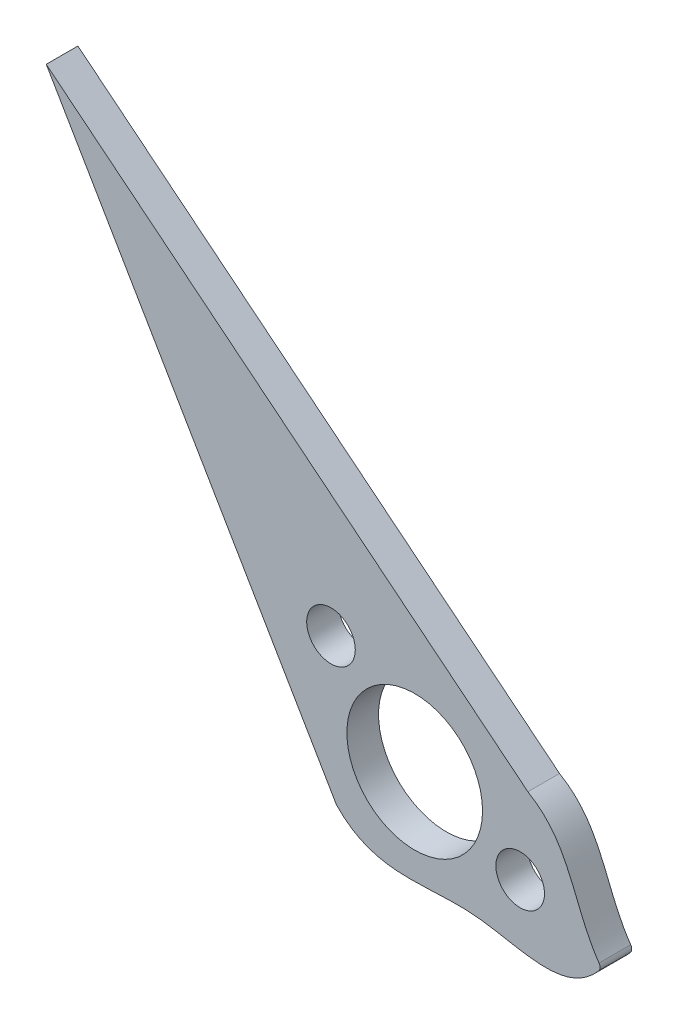
ISO-10303-21;
HEADER;
FILE_DESCRIPTION(('STEP AP214'),'2;1');
FILE_NAME('part.step','',(''),(''),'','','');
FILE_SCHEMA(('AUTOMOTIVE_DESIGN { 1 0 10303 214 1 1 1 1 }'));
ENDSEC;
DATA;
#1=APPLICATION_CONTEXT('core data for automotive mechanical design processes');
#2=APPLICATION_PROTOCOL_DEFINITION('international standard','automotive_design',2000,#1);
#3=PRODUCT_CONTEXT('',#1,'mechanical');
#4=PRODUCT('Part','Part','',(#3));
#5=PRODUCT_RELATED_PRODUCT_CATEGORY('part','',(#4));
#6=PRODUCT_DEFINITION_FORMATION('','',#4);
#7=PRODUCT_DEFINITION_CONTEXT('part definition',#1,'design');
#8=PRODUCT_DEFINITION('design','',#6,#7);
#9=PRODUCT_DEFINITION_SHAPE('','',#8);
#10=(LENGTH_UNIT() NAMED_UNIT(*) SI_UNIT(.MILLI.,.METRE.));
#11=(NAMED_UNIT(*) PLANE_ANGLE_UNIT() SI_UNIT($,.RADIAN.));
#12=(NAMED_UNIT(*) SI_UNIT($,.STERADIAN.) SOLID_ANGLE_UNIT());
#13=UNCERTAINTY_MEASURE_WITH_UNIT(LENGTH_MEASURE(1.E-05),#10,'distance_accuracy_value','');
#14=(GEOMETRIC_REPRESENTATION_CONTEXT(3) GLOBAL_UNCERTAINTY_ASSIGNED_CONTEXT((#13)) GLOBAL_UNIT_ASSIGNED_CONTEXT((#10,
#11,#12)) REPRESENTATION_CONTEXT('',''));
#15=CARTESIAN_POINT('',(0.,0.,0.));
#16=DIRECTION('',(0.,0.,1.));
#17=DIRECTION('',(1.,0.,0.));
#18=AXIS2_PLACEMENT_3D('',#15,#16,#17);
#19=CARTESIAN_POINT('',(-7.76901962768053,-4.54338354365057,2.8));
#20=DIRECTION('',(-0.863224403075614,-0.504820393738952,0.));
#21=DIRECTION('',(0.504820393738952,-0.863224403075614,0.));
#22=AXIS2_PLACEMENT_3D('',#19,#20,#21);
#23=PLANE('',#22);
#24=DIRECTION('',(-0.504820393738952,0.863224403075614,0.));
#25=VECTOR('',#24,1.);
#26=CARTESIAN_POINT('',(-7.76901962768053,-4.54338354365057,0.));
#27=LINE('',#26,#25);
#28=CARTESIAN_POINT('',(-6.91490358434265,-6.0038907276153,0.));
#29=VERTEX_POINT('',#28);
#30=CARTESIAN_POINT('',(-32.5977679008449,37.9128675766243,0.));
#31=VERTEX_POINT('',#30);
#32=EDGE_CURVE('E91',#29,#31,#27,.T.);
#33=ORIENTED_EDGE('',*,*,#32,.F.);
#34=DIRECTION('',(0.,0.,-1.));
#35=VECTOR('',#34,1.);
#36=CARTESIAN_POINT('',(-6.91490358434265,-6.0038907276153,2.8));
#37=LINE('',#36,#35);
#38=CARTESIAN_POINT('',(-6.91490358434265,-6.0038907276153,2.8));
#39=VERTEX_POINT('',#38);
#40=EDGE_CURVE('E86',#39,#29,#37,.T.);
#41=ORIENTED_EDGE('',*,*,#40,.F.);
#42=DIRECTION('',(-0.504820393738952,0.863224403075614,0.));
#43=VECTOR('',#42,1.);
#44=CARTESIAN_POINT('',(-7.76901962768053,-4.54338354365057,2.8));
#45=LINE('',#44,#43);
#46=CARTESIAN_POINT('',(-32.5977679008449,37.9128675766243,2.8));
#47=VERTEX_POINT('',#46);
#48=EDGE_CURVE('E88',#39,#47,#45,.T.);
#49=ORIENTED_EDGE('',*,*,#48,.T.);
#50=DIRECTION('',(0.,0.,-1.));
#51=VECTOR('',#50,1.);
#52=CARTESIAN_POINT('',(-32.5977679008449,37.9128675766243,2.8));
#53=LINE('',#52,#51);
#54=EDGE_CURVE('E179',#47,#31,#53,.T.);
#55=ORIENTED_EDGE('',*,*,#54,.T.);
#56=EDGE_LOOP('',(#33,#41,#49,#55));
#57=FACE_BOUND('',#56,.T.);
#58=ADVANCED_FACE('F39',(#57),#23,.T.);
#59=CARTESIAN_POINT('',(-6.91490358434265,-6.0038907276153,2.8));
#60=CARTESIAN_POINT('',(-3.45265207988575,-9.61034721728087,2.8));
#61=CARTESIAN_POINT('',(5.03407419755708,-6.4625226572388,2.8));
#62=CARTESIAN_POINT('',(13.4160902183811,-10.7832767779476,2.8));
#63=CARTESIAN_POINT('',(16.5349721584418,-6.79572931557715,2.8));
#64=B_SPLINE_CURVE_WITH_KNOTS('',3,(#59,#60,#61,#62,#63),.UNSPECIFIED.,.F.,.F.,(4,1,4),(0.,
0.517120054105713,1.),.UNSPECIFIED.);
#65=DIRECTION('',(0.,0.,-1.));
#66=VECTOR('',#65,1.);
#67=SURFACE_OF_LINEAR_EXTRUSION('',#64,#66);
#68=CARTESIAN_POINT('',(-6.91490358434265,-6.0038907276153,0.));
#69=CARTESIAN_POINT('',(-3.45265207988575,-9.61034721728087,0.));
#70=CARTESIAN_POINT('',(5.03407419755708,-6.4625226572388,0.));
#71=CARTESIAN_POINT('',(13.4160902183811,-10.7832767779476,0.));
#72=CARTESIAN_POINT('',(16.5349721584418,-6.79572931557715,0.));
#73=B_SPLINE_CURVE_WITH_KNOTS('',3,(#68,#69,#70,#71,#72),.UNSPECIFIED.,.F.,.F.,(4,1,4),(0.,
0.517120054105713,1.),.UNSPECIFIED.);
#74=CARTESIAN_POINT('',(16.2799246551413,-7.10605918624335,0.));
#75=VERTEX_POINT('',#74);
#76=EDGE_CURVE('E162',#29,#75,#73,.T.);
#77=ORIENTED_EDGE('',*,*,#76,.T.);
#78=DIRECTION('',(0.,0.,-1.));
#79=VECTOR('',#78,1.);
#80=CARTESIAN_POINT('',(16.2799246551413,-7.10605918624335,0.));
#81=LINE('',#80,#79);
#82=CARTESIAN_POINT('',(16.2799246551413,-7.10605918624335,2.8));
#83=VERTEX_POINT('',#82);
#84=EDGE_CURVE('E47',#75,#83,#81,.F.);
#85=ORIENTED_EDGE('',*,*,#84,.T.);
#86=EDGE_CURVE('E95',#39,#83,#64,.T.);
#87=ORIENTED_EDGE('',*,*,#86,.F.);
#88=ORIENTED_EDGE('',*,*,#40,.T.);
#89=EDGE_LOOP('',(#77,#85,#87,#88));
#90=FACE_BOUND('',#89,.T.);
#91=ADVANCED_FACE('F96',(#90),#67,.F.);
#92=CARTESIAN_POINT('',(10.012592639471,3.48020666958084,2.8));
#93=CARTESIAN_POINT('',(13.9762411677783,1.19272774491821,2.8));
#94=CARTESIAN_POINT('',(14.0145214147147,-3.51898668171003,2.8));
#95=CARTESIAN_POINT('',(16.5349721584418,-6.79572931557715,2.8));
#96=B_SPLINE_CURVE_WITH_KNOTS('',3,(#92,#93,#94,#95),.UNSPECIFIED.,.F.,.F.,(4,4),(0.,1.),.UNSPECIFIED.);
#97=DIRECTION('',(0.,0.,-1.));
#98=VECTOR('',#97,1.);
#99=SURFACE_OF_LINEAR_EXTRUSION('',#96,#98);
#100=CARTESIAN_POINT('',(10.012592639471,3.48020666958083,2.8));
#101=VERTEX_POINT('',#100);
#102=CARTESIAN_POINT('',(16.3100680728734,-6.49055705341188,2.8));
#103=VERTEX_POINT('',#102);
#104=EDGE_CURVE('E99',#101,#103,#96,.T.);
#105=ORIENTED_EDGE('',*,*,#104,.T.);
#106=DIRECTION('',(0.,0.,-1.));
#107=VECTOR('',#106,1.);
#108=CARTESIAN_POINT('',(16.3100680728734,-6.49055705341188,2.8));
#109=LINE('',#108,#107);
#110=CARTESIAN_POINT('',(16.3100680728734,-6.49055705341188,0.));
#111=VERTEX_POINT('',#110);
#112=EDGE_CURVE('E92',#103,#111,#109,.T.);
#113=ORIENTED_EDGE('',*,*,#112,.T.);
#114=CARTESIAN_POINT('',(10.012592639471,3.48020666958084,0.));
#115=CARTESIAN_POINT('',(13.9762411677783,1.19272774491821,0.));
#116=CARTESIAN_POINT('',(14.0145214147147,-3.51898668171003,0.));
#117=CARTESIAN_POINT('',(16.5349721584418,-6.79572931557715,0.));
#118=B_SPLINE_CURVE_WITH_KNOTS('',3,(#114,#115,#116,#117),.UNSPECIFIED.,.F.,.F.,(4,4),(0.,1.),.UNSPECIFIED.);
#119=CARTESIAN_POINT('',(10.012592639471,3.48020666958083,0.));
#120=VERTEX_POINT('',#119);
#121=EDGE_CURVE('E166',#120,#111,#118,.T.);
#122=ORIENTED_EDGE('',*,*,#121,.F.);
#123=DIRECTION('',(0.,0.,-1.));
#124=VECTOR('',#123,1.);
#125=CARTESIAN_POINT('',(10.012592639471,3.48020666958083,2.8));
#126=LINE('',#125,#124);
#127=EDGE_CURVE('E93',#101,#120,#126,.T.);
#128=ORIENTED_EDGE('',*,*,#127,.F.);
#129=EDGE_LOOP('',(#105,#113,#122,#128));
#130=FACE_BOUND('',#129,.T.);
#131=ADVANCED_FACE('F126',(#130),#99,.T.);
#132=CARTESIAN_POINT('',(9.32923005130768,-3.60075917686503,2.8));
#133=DIRECTION('',(0.,0.,-1.));
#134=DIRECTION('',(-1.,0.,0.));
#135=AXIS2_PLACEMENT_3D('',#132,#133,#134);
#136=CYLINDRICAL_SURFACE('',#135,2.15);
#137=CARTESIAN_POINT('',(9.32923005130768,-3.60075917686503,2.8));
#138=DIRECTION('',(0.,0.,1.));
#139=DIRECTION('',(1.,0.,0.));
#140=AXIS2_PLACEMENT_3D('',#137,#138,#139);
#141=CIRCLE('',#140,2.15);
#142=CARTESIAN_POINT('',(11.4792300513077,-3.60075917686503,2.8));
#143=VERTEX_POINT('',#142);
#144=EDGE_CURVE('E105',#143,#143,#141,.T.);
#145=ORIENTED_EDGE('',*,*,#144,.T.);
#146=EDGE_LOOP('',(#145));
#147=FACE_BOUND('',#146,.T.);
#148=CARTESIAN_POINT('',(9.32923005130768,-3.60075917686503,0.));
#149=DIRECTION('',(0.,0.,1.));
#150=DIRECTION('',(1.,0.,0.));
#151=AXIS2_PLACEMENT_3D('',#148,#149,#150);
#152=CIRCLE('',#151,2.15);
#153=CARTESIAN_POINT('',(11.4792300513077,-3.60075917686503,0.));
#154=VERTEX_POINT('',#153);
#155=EDGE_CURVE('E156',#154,#154,#152,.T.);
#156=ORIENTED_EDGE('',*,*,#155,.F.);
#157=EDGE_LOOP('',(#156));
#158=FACE_BOUND('',#157,.T.);
#159=ADVANCED_FACE('F130',(#147,#158),#136,.F.);
#160=CARTESIAN_POINT('',(-7.40694983508878,6.71841455556877,2.8));
#161=DIRECTION('',(0.,0.,-1.));
#162=DIRECTION('',(-1.,0.,0.));
#163=AXIS2_PLACEMENT_3D('',#160,#161,#162);
#164=CYLINDRICAL_SURFACE('',#163,2.15);
#165=CARTESIAN_POINT('',(-7.40694983508878,6.71841455556877,2.8));
#166=DIRECTION('',(0.,0.,1.));
#167=DIRECTION('',(1.,0.,0.));
#168=AXIS2_PLACEMENT_3D('',#165,#166,#167);
#169=CIRCLE('',#168,2.15);
#170=CARTESIAN_POINT('',(-5.25694983508878,6.71841455556877,2.8));
#171=VERTEX_POINT('',#170);
#172=EDGE_CURVE('E108',#171,#171,#169,.T.);
#173=ORIENTED_EDGE('',*,*,#172,.T.);
#174=EDGE_LOOP('',(#173));
#175=FACE_BOUND('',#174,.T.);
#176=CARTESIAN_POINT('',(-7.40694983508878,6.71841455556877,0.));
#177=DIRECTION('',(0.,0.,1.));
#178=DIRECTION('',(1.,0.,0.));
#179=AXIS2_PLACEMENT_3D('',#176,#177,#178);
#180=CIRCLE('',#179,2.15);
#181=CARTESIAN_POINT('',(-5.25694983508878,6.71841455556877,0.));
#182=VERTEX_POINT('',#181);
#183=EDGE_CURVE('E153',#182,#182,#180,.T.);
#184=ORIENTED_EDGE('',*,*,#183,.F.);
#185=EDGE_LOOP('',(#184));
#186=FACE_BOUND('',#185,.T.);
#187=ADVANCED_FACE('F133',(#175,#186),#164,.F.);
#188=CARTESIAN_POINT('',(0.,0.,2.8));
#189=DIRECTION('',(0.,0.,-1.));
#190=DIRECTION('',(-1.,0.,0.));
#191=AXIS2_PLACEMENT_3D('',#188,#189,#190);
#192=CYLINDRICAL_SURFACE('',#191,6.);
#193=CARTESIAN_POINT('',(0.,0.,2.8));
#194=DIRECTION('',(0.,0.,1.));
#195=DIRECTION('',(1.,0.,0.));
#196=AXIS2_PLACEMENT_3D('',#193,#194,#195);
#197=CIRCLE('',#196,6.);
#198=CARTESIAN_POINT('',(6.,0.,2.8));
#199=VERTEX_POINT('',#198);
#200=EDGE_CURVE('E148',#199,#199,#197,.T.);
#201=ORIENTED_EDGE('',*,*,#200,.T.);
#202=EDGE_LOOP('',(#201));
#203=FACE_BOUND('',#202,.T.);
#204=CARTESIAN_POINT('',(0.,0.,0.));
#205=DIRECTION('',(0.,0.,1.));
#206=DIRECTION('',(1.,0.,0.));
#207=AXIS2_PLACEMENT_3D('',#204,#205,#206);
#208=CIRCLE('',#207,6.);
#209=CARTESIAN_POINT('',(6.,0.,0.));
#210=VERTEX_POINT('',#209);
#211=EDGE_CURVE('E151',#210,#210,#208,.T.);
#212=ORIENTED_EDGE('',*,*,#211,.F.);
#213=EDGE_LOOP('',(#212));
#214=FACE_BOUND('',#213,.T.);
#215=ADVANCED_FACE('F136',(#203,#214),#192,.F.);
#216=CARTESIAN_POINT('',(5.65668426770577,7.00013736261581,2.8));
#217=DIRECTION('',(0.628520474189531,0.777793040290647,0.));
#218=DIRECTION('',(-0.777793040290647,0.628520474189531,0.));
#219=AXIS2_PLACEMENT_3D('',#216,#217,#218);
#220=PLANE('',#219);
#221=DIRECTION('',(0.777793040290647,-0.628520474189531,0.));
#222=VECTOR('',#221,1.);
#223=CARTESIAN_POINT('',(5.65668426770577,7.00013736261581,0.));
#224=LINE('',#223,#222);
#225=EDGE_CURVE('E173',#31,#120,#224,.T.);
#226=ORIENTED_EDGE('',*,*,#225,.F.);
#227=ORIENTED_EDGE('',*,*,#54,.F.);
#228=DIRECTION('',(0.777793040290647,-0.628520474189531,0.));
#229=VECTOR('',#228,1.);
#230=CARTESIAN_POINT('',(5.65668426770577,7.00013736261581,2.8));
#231=LINE('',#230,#229);
#232=EDGE_CURVE('E104',#47,#101,#231,.T.);
#233=ORIENTED_EDGE('',*,*,#232,.T.);
#234=ORIENTED_EDGE('',*,*,#127,.T.);
#235=EDGE_LOOP('',(#226,#227,#233,#234));
#236=FACE_BOUND('',#235,.T.);
#237=ADVANCED_FACE('F139',(#236),#220,.T.);
#238=CARTESIAN_POINT('',(0.,0.,2.8));
#239=DIRECTION('',(0.,0.,1.));
#240=DIRECTION('',(1.,0.,0.));
#241=AXIS2_PLACEMENT_3D('',#238,#239,#240);
#242=PLANE('',#241);
#243=ORIENTED_EDGE('',*,*,#200,.F.);
#244=EDGE_LOOP('',(#243));
#245=FACE_BOUND('',#244,.T.);
#246=ORIENTED_EDGE('',*,*,#172,.F.);
#247=EDGE_LOOP('',(#246));
#248=FACE_BOUND('',#247,.T.);
#249=ORIENTED_EDGE('',*,*,#144,.F.);
#250=EDGE_LOOP('',(#249));
#251=FACE_BOUND('',#250,.T.);
#252=ORIENTED_EDGE('',*,*,#86,.T.);
#253=CARTESIAN_POINT('',(15.9016884567287,-6.779046375775,2.8));
#254=DIRECTION('',(0.,0.,1.));
#255=DIRECTION('',(1.,0.,0.));
#256=AXIS2_PLACEMENT_3D('',#253,#254,#255);
#257=CIRCLE('',#256,0.5);
#258=EDGE_CURVE('E11',#83,#103,#257,.T.);
#259=ORIENTED_EDGE('',*,*,#258,.T.);
#260=ORIENTED_EDGE('',*,*,#104,.F.);
#261=ORIENTED_EDGE('',*,*,#232,.F.);
#262=ORIENTED_EDGE('',*,*,#48,.F.);
#263=EDGE_LOOP('',(#252,#259,#260,#261,#262));
#264=FACE_BOUND('',#263,.T.);
#265=ADVANCED_FACE('F101',(#245,#248,#251,#264),#242,.T.);
#266=CARTESIAN_POINT('',(0.,0.,0.));
#267=DIRECTION('',(0.,0.,1.));
#268=DIRECTION('',(1.,0.,0.));
#269=AXIS2_PLACEMENT_3D('',#266,#267,#268);
#270=PLANE('',#269);
#271=ORIENTED_EDGE('',*,*,#211,.T.);
#272=EDGE_LOOP('',(#271));
#273=FACE_BOUND('',#272,.T.);
#274=ORIENTED_EDGE('',*,*,#183,.T.);
#275=EDGE_LOOP('',(#274));
#276=FACE_BOUND('',#275,.T.);
#277=ORIENTED_EDGE('',*,*,#155,.T.);
#278=EDGE_LOOP('',(#277));
#279=FACE_BOUND('',#278,.T.);
#280=ORIENTED_EDGE('',*,*,#121,.T.);
#281=CARTESIAN_POINT('',(15.9016884567287,-6.779046375775,0.));
#282=DIRECTION('',(0.,0.,1.));
#283=DIRECTION('',(1.,0.,0.));
#284=AXIS2_PLACEMENT_3D('',#281,#282,#283);
#285=CIRCLE('',#284,0.5);
#286=EDGE_CURVE('E61',#111,#75,#285,.F.);
#287=ORIENTED_EDGE('',*,*,#286,.T.);
#288=ORIENTED_EDGE('',*,*,#76,.F.);
#289=ORIENTED_EDGE('',*,*,#32,.T.);
#290=ORIENTED_EDGE('',*,*,#225,.T.);
#291=EDGE_LOOP('',(#280,#287,#288,#289,#290));
#292=FACE_BOUND('',#291,.T.);
#293=ADVANCED_FACE('F189',(#273,#276,#279,#292),#270,.F.);
#294=CARTESIAN_POINT('',(15.9016884567287,-6.779046375775,1.4));
#295=DIRECTION('',(0.,0.,-1.));
#296=DIRECTION('',(-1.,0.,0.));
#297=AXIS2_PLACEMENT_3D('',#294,#295,#296);
#298=CYLINDRICAL_SURFACE('',#297,0.5);
#299=ORIENTED_EDGE('',*,*,#258,.F.);
#300=ORIENTED_EDGE('',*,*,#84,.F.);
#301=ORIENTED_EDGE('',*,*,#286,.F.);
#302=ORIENTED_EDGE('',*,*,#112,.F.);
#303=EDGE_LOOP('',(#299,#300,#301,#302));
#304=FACE_BOUND('',#303,.T.);
#305=ADVANCED_FACE('F41',(#304),#298,.T.);
#306=CLOSED_SHELL('',(#58,#91,#131,#159,#187,#215,#237,#265,#293,#305));
#307=MANIFOLD_SOLID_BREP('B2',#306);
#308=ADVANCED_BREP_SHAPE_REPRESENTATION('',(#18,#307),#14);
#309=SHAPE_DEFINITION_REPRESENTATION(#9,#308);
ENDSEC;
END-ISO-10303-21;
